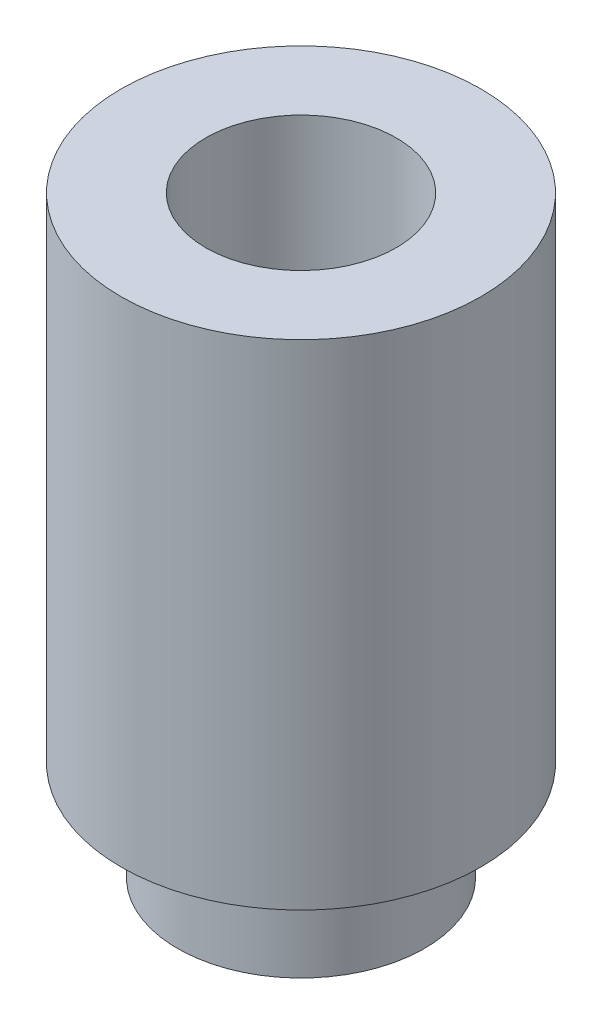
ISO-10303-21;
HEADER;
FILE_DESCRIPTION(('STEP AP214'),'2;1');
FILE_NAME('part.step','',(''),(''),'','','');
FILE_SCHEMA(('AUTOMOTIVE_DESIGN { 1 0 10303 214 1 1 1 1 }'));
ENDSEC;
DATA;
#1=APPLICATION_CONTEXT('core data for automotive mechanical design processes');
#2=APPLICATION_PROTOCOL_DEFINITION('international standard','automotive_design',2000,#1);
#3=PRODUCT_CONTEXT('',#1,'mechanical');
#4=PRODUCT('Part','Part','',(#3));
#5=PRODUCT_RELATED_PRODUCT_CATEGORY('part','',(#4));
#6=PRODUCT_DEFINITION_FORMATION('','',#4);
#7=PRODUCT_DEFINITION_CONTEXT('part definition',#1,'design');
#8=PRODUCT_DEFINITION('design','',#6,#7);
#9=PRODUCT_DEFINITION_SHAPE('','',#8);
#10=(LENGTH_UNIT() NAMED_UNIT(*) SI_UNIT(.MILLI.,.METRE.));
#11=(NAMED_UNIT(*) PLANE_ANGLE_UNIT() SI_UNIT($,.RADIAN.));
#12=(NAMED_UNIT(*) SI_UNIT($,.STERADIAN.) SOLID_ANGLE_UNIT());
#13=UNCERTAINTY_MEASURE_WITH_UNIT(LENGTH_MEASURE(1.E-05),#10,'distance_accuracy_value','');
#14=(GEOMETRIC_REPRESENTATION_CONTEXT(3) GLOBAL_UNCERTAINTY_ASSIGNED_CONTEXT((#13)) GLOBAL_UNIT_ASSIGNED_CONTEXT((#10,
#11,#12)) REPRESENTATION_CONTEXT('',''));
#15=CARTESIAN_POINT('',(0.,0.,0.));
#16=DIRECTION('',(0.,0.,1.));
#17=DIRECTION('',(1.,0.,0.));
#18=AXIS2_PLACEMENT_3D('',#15,#16,#17);
#19=CARTESIAN_POINT('',(35.4,0.8,-50.4));
#20=DIRECTION('',(0.,-1.,0.));
#21=DIRECTION('',(0.,0.,-1.));
#22=AXIS2_PLACEMENT_3D('',#19,#20,#21);
#23=CYLINDRICAL_SURFACE('',#22,1.75);
#24=CARTESIAN_POINT('',(35.4,-0.6,-50.4));
#25=DIRECTION('',(0.,-1.,0.));
#26=DIRECTION('',(0.,0.,-1.));
#27=AXIS2_PLACEMENT_3D('',#24,#25,#26);
#28=CIRCLE('',#27,1.75);
#29=CARTESIAN_POINT('',(35.4,-0.6,-52.15));
#30=VERTEX_POINT('',#29);
#31=EDGE_CURVE('E35',#30,#30,#28,.T.);
#32=ORIENTED_EDGE('',*,*,#31,.F.);
#33=EDGE_LOOP('',(#32));
#34=FACE_BOUND('',#33,.T.);
#35=CARTESIAN_POINT('',(35.4,0.8,-50.4));
#36=DIRECTION('',(0.,-1.,0.));
#37=DIRECTION('',(0.,0.,-1.));
#38=AXIS2_PLACEMENT_3D('',#35,#36,#37);
#39=CIRCLE('',#38,1.75);
#40=CARTESIAN_POINT('',(35.4,0.8,-52.15));
#41=VERTEX_POINT('',#40);
#42=EDGE_CURVE('E19',#41,#41,#39,.F.);
#43=ORIENTED_EDGE('',*,*,#42,.F.);
#44=EDGE_LOOP('',(#43));
#45=FACE_BOUND('',#44,.T.);
#46=ADVANCED_FACE('F15',(#34,#45),#23,.T.);
#47=CARTESIAN_POINT('',(32.799,0.8,-53.0056334439927));
#48=DIRECTION('',(0.,-1.,0.));
#49=DIRECTION('',(1.,0.,0.));
#50=AXIS2_PLACEMENT_3D('',#47,#48,#49);
#51=PLANE('',#50);
#52=ORIENTED_EDGE('',*,*,#42,.T.);
#53=EDGE_LOOP('',(#52));
#54=FACE_BOUND('',#53,.T.);
#55=CARTESIAN_POINT('',(35.4,0.8,-50.4));
#56=DIRECTION('',(0.,-1.,0.));
#57=DIRECTION('',(0.,0.,-1.));
#58=AXIS2_PLACEMENT_3D('',#55,#56,#57);
#59=CIRCLE('',#58,2.55);
#60=CARTESIAN_POINT('',(35.4,0.8,-52.95));
#61=VERTEX_POINT('',#60);
#62=EDGE_CURVE('E33',#61,#61,#59,.T.);
#63=ORIENTED_EDGE('',*,*,#62,.T.);
#64=EDGE_LOOP('',(#63));
#65=FACE_BOUND('',#64,.T.);
#66=ADVANCED_FACE('F42',(#54,#65),#51,.T.);
#67=CARTESIAN_POINT('',(33.615,-0.6,-52.195576627153));
#68=DIRECTION('',(0.,-1.,0.));
#69=DIRECTION('',(1.,0.,0.));
#70=AXIS2_PLACEMENT_3D('',#67,#68,#69);
#71=PLANE('',#70);
#72=CARTESIAN_POINT('',(35.4,-0.6,-50.4));
#73=DIRECTION('',(0.,1.,0.));
#74=DIRECTION('',(0.,0.,1.));
#75=AXIS2_PLACEMENT_3D('',#72,#73,#74);
#76=CIRCLE('',#75,1.35);
#77=CARTESIAN_POINT('',(35.4,-0.6,-49.05));
#78=VERTEX_POINT('',#77);
#79=EDGE_CURVE('E28',#78,#78,#76,.F.);
#80=ORIENTED_EDGE('',*,*,#79,.F.);
#81=EDGE_LOOP('',(#80));
#82=FACE_BOUND('',#81,.T.);
#83=ORIENTED_EDGE('',*,*,#31,.T.);
#84=EDGE_LOOP('',(#83));
#85=FACE_BOUND('',#84,.T.);
#86=ADVANCED_FACE('F52',(#82,#85),#71,.T.);
#87=CARTESIAN_POINT('',(35.4,7.8,-50.4));
#88=DIRECTION('',(0.,-1.,0.));
#89=DIRECTION('',(0.,0.,-1.));
#90=AXIS2_PLACEMENT_3D('',#87,#88,#89);
#91=CYLINDRICAL_SURFACE('',#90,2.55);
#92=ORIENTED_EDGE('',*,*,#62,.F.);
#93=EDGE_LOOP('',(#92));
#94=FACE_BOUND('',#93,.T.);
#95=CARTESIAN_POINT('',(35.4,7.8,-50.4));
#96=DIRECTION('',(0.,-1.,0.));
#97=DIRECTION('',(0.,0.,-1.));
#98=AXIS2_PLACEMENT_3D('',#95,#96,#97);
#99=CIRCLE('',#98,2.55);
#100=CARTESIAN_POINT('',(35.4,7.8,-52.95));
#101=VERTEX_POINT('',#100);
#102=EDGE_CURVE('E23',#101,#101,#99,.T.);
#103=ORIENTED_EDGE('',*,*,#102,.T.);
#104=EDGE_LOOP('',(#103));
#105=FACE_BOUND('',#104,.T.);
#106=ADVANCED_FACE('F61',(#94,#105),#91,.T.);
#107=CARTESIAN_POINT('',(35.4,-0.6,-50.4));
#108=DIRECTION('',(0.,1.,0.));
#109=DIRECTION('',(0.,0.,1.));
#110=AXIS2_PLACEMENT_3D('',#107,#108,#109);
#111=CYLINDRICAL_SURFACE('',#110,1.35);
#112=ORIENTED_EDGE('',*,*,#79,.T.);
#113=EDGE_LOOP('',(#112));
#114=FACE_BOUND('',#113,.T.);
#115=CARTESIAN_POINT('',(35.4,7.8,-50.4));
#116=DIRECTION('',(0.,1.,0.));
#117=DIRECTION('',(0.,0.,1.));
#118=AXIS2_PLACEMENT_3D('',#115,#116,#117);
#119=CIRCLE('',#118,1.35);
#120=CARTESIAN_POINT('',(35.4,7.8,-49.05));
#121=VERTEX_POINT('',#120);
#122=EDGE_CURVE('E10',#121,#121,#119,.T.);
#123=ORIENTED_EDGE('',*,*,#122,.T.);
#124=EDGE_LOOP('',(#123));
#125=FACE_BOUND('',#124,.T.);
#126=ADVANCED_FACE('F56',(#114,#125),#111,.F.);
#127=CARTESIAN_POINT('',(32.799,7.8,-53.0056334439927));
#128=DIRECTION('',(0.,-1.,0.));
#129=DIRECTION('',(1.,0.,0.));
#130=AXIS2_PLACEMENT_3D('',#127,#128,#129);
#131=PLANE('',#130);
#132=ORIENTED_EDGE('',*,*,#122,.F.);
#133=EDGE_LOOP('',(#132));
#134=FACE_BOUND('',#133,.T.);
#135=ORIENTED_EDGE('',*,*,#102,.F.);
#136=EDGE_LOOP('',(#135));
#137=FACE_BOUND('',#136,.T.);
#138=ADVANCED_FACE('F17',(#134,#137),#131,.F.);
#139=CLOSED_SHELL('',(#46,#66,#86,#106,#126,#138));
#140=MANIFOLD_SOLID_BREP('B1',#139);
#141=ADVANCED_BREP_SHAPE_REPRESENTATION('',(#18,#140),#14);
#142=SHAPE_DEFINITION_REPRESENTATION(#9,#141);
ENDSEC;
END-ISO-10303-21;
